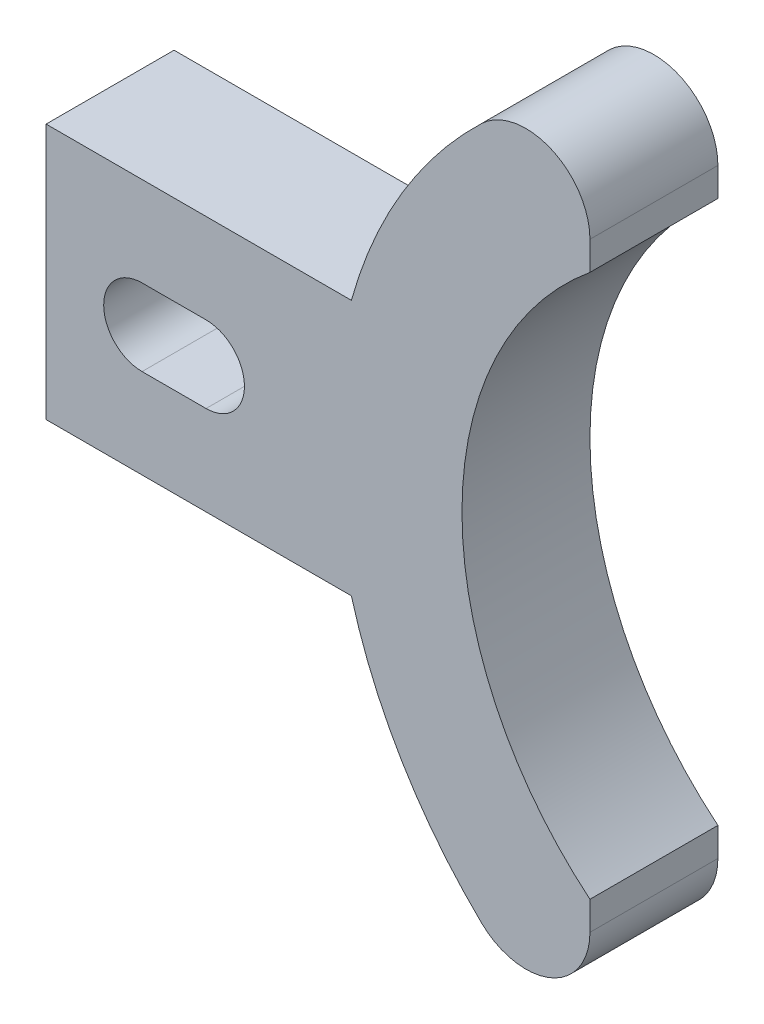
ISO-10303-21;
HEADER;
FILE_DESCRIPTION(('STEP AP214'),'2;1');
FILE_NAME('part.step','',(''),(''),'','','');
FILE_SCHEMA(('AUTOMOTIVE_DESIGN { 1 0 10303 214 1 1 1 1 }'));
ENDSEC;
DATA;
#1=APPLICATION_CONTEXT('core data for automotive mechanical design processes');
#2=APPLICATION_PROTOCOL_DEFINITION('international standard','automotive_design',2000,#1);
#3=PRODUCT_CONTEXT('',#1,'mechanical');
#4=PRODUCT('Part','Part','',(#3));
#5=PRODUCT_RELATED_PRODUCT_CATEGORY('part','',(#4));
#6=PRODUCT_DEFINITION_FORMATION('','',#4);
#7=PRODUCT_DEFINITION_CONTEXT('part definition',#1,'design');
#8=PRODUCT_DEFINITION('design','',#6,#7);
#9=PRODUCT_DEFINITION_SHAPE('','',#8);
#10=(LENGTH_UNIT() NAMED_UNIT(*) SI_UNIT(.MILLI.,.METRE.));
#11=(NAMED_UNIT(*) PLANE_ANGLE_UNIT() SI_UNIT($,.RADIAN.));
#12=(NAMED_UNIT(*) SI_UNIT($,.STERADIAN.) SOLID_ANGLE_UNIT());
#13=UNCERTAINTY_MEASURE_WITH_UNIT(LENGTH_MEASURE(1.E-05),#10,'distance_accuracy_value','');
#14=(GEOMETRIC_REPRESENTATION_CONTEXT(3) GLOBAL_UNCERTAINTY_ASSIGNED_CONTEXT((#13)) GLOBAL_UNIT_ASSIGNED_CONTEXT((#10,
#11,#12)) REPRESENTATION_CONTEXT('',''));
#15=CARTESIAN_POINT('',(0.,0.,0.));
#16=DIRECTION('',(0.,0.,1.));
#17=DIRECTION('',(1.,0.,0.));
#18=AXIS2_PLACEMENT_3D('',#15,#16,#17);
#19=CARTESIAN_POINT('',(76.2,12.7,12.7));
#20=DIRECTION('',(0.,0.,-1.));
#21=DIRECTION('',(-1.,0.,0.));
#22=AXIS2_PLACEMENT_3D('',#19,#20,#21);
#23=CYLINDRICAL_SURFACE('',#22,47.625);
#24=CARTESIAN_POINT('',(76.2,12.7,0.));
#25=DIRECTION('',(0.,0.,1.));
#26=DIRECTION('',(1.,0.,0.));
#27=AXIS2_PLACEMENT_3D('',#24,#25,#26);
#28=CIRCLE('',#27,47.625);
#29=CARTESIAN_POINT('',(30.2995574640069,0.,0.));
#30=VERTEX_POINT('',#29);
#31=CARTESIAN_POINT('',(43.2288461538462,-21.666315471014,0.));
#32=VERTEX_POINT('',#31);
#33=EDGE_CURVE('E234',#30,#32,#28,.T.);
#34=ORIENTED_EDGE('',*,*,#33,.T.);
#35=DIRECTION('',(0.,0.,-1.));
#36=VECTOR('',#35,1.);
#37=CARTESIAN_POINT('',(43.2288461538462,-21.666315471014,12.7));
#38=LINE('',#37,#36);
#39=CARTESIAN_POINT('',(43.2288461538462,-21.666315471014,12.7));
#40=VERTEX_POINT('',#39);
#41=EDGE_CURVE('E280',#32,#40,#38,.F.);
#42=ORIENTED_EDGE('',*,*,#41,.T.);
#43=CARTESIAN_POINT('',(76.2,12.7,12.7));
#44=DIRECTION('',(0.,0.,1.));
#45=DIRECTION('',(1.,0.,0.));
#46=AXIS2_PLACEMENT_3D('',#43,#44,#45);
#47=CIRCLE('',#46,47.625);
#48=CARTESIAN_POINT('',(30.2995574640069,0.,12.7));
#49=VERTEX_POINT('',#48);
#50=EDGE_CURVE('E209',#49,#40,#47,.T.);
#51=ORIENTED_EDGE('',*,*,#50,.F.);
#52=DIRECTION('',(0.,0.,-1.));
#53=VECTOR('',#52,1.);
#54=CARTESIAN_POINT('',(30.2995574640069,0.,12.7));
#55=LINE('',#54,#53);
#56=EDGE_CURVE('E261',#49,#30,#55,.T.);
#57=ORIENTED_EDGE('',*,*,#56,.T.);
#58=EDGE_LOOP('',(#34,#42,#51,#57));
#59=FACE_BOUND('',#58,.T.);
#60=ADVANCED_FACE('F41',(#59),#23,.T.);
#61=CARTESIAN_POINT('',(76.2,12.7,12.7));
#62=DIRECTION('',(0.,0.,-1.));
#63=DIRECTION('',(-1.,0.,0.));
#64=AXIS2_PLACEMENT_3D('',#61,#62,#63);
#65=CYLINDRICAL_SURFACE('',#64,34.925);
#66=CARTESIAN_POINT('',(76.2,12.7,12.7));
#67=DIRECTION('',(0.,0.,1.));
#68=DIRECTION('',(1.,0.,0.));
#69=AXIS2_PLACEMENT_3D('',#66,#67,#68);
#70=CIRCLE('',#69,34.925);
#71=CARTESIAN_POINT('',(53.975,39.6407683632075,12.7));
#72=VERTEX_POINT('',#71);
#73=CARTESIAN_POINT('',(53.975,-14.2407683632075,12.7));
#74=VERTEX_POINT('',#73);
#75=EDGE_CURVE('E214',#72,#74,#70,.T.);
#76=ORIENTED_EDGE('',*,*,#75,.T.);
#77=DIRECTION('',(0.,0.,-1.));
#78=VECTOR('',#77,1.);
#79=CARTESIAN_POINT('',(53.975,-14.2407683632075,12.7));
#80=LINE('',#79,#78);
#81=CARTESIAN_POINT('',(53.975,-14.2407683632075,0.));
#82=VERTEX_POINT('',#81);
#83=EDGE_CURVE('E200',#74,#82,#80,.T.);
#84=ORIENTED_EDGE('',*,*,#83,.T.);
#85=CARTESIAN_POINT('',(76.2,12.7,0.));
#86=DIRECTION('',(0.,0.,1.));
#87=DIRECTION('',(1.,0.,0.));
#88=AXIS2_PLACEMENT_3D('',#85,#86,#87);
#89=CIRCLE('',#88,34.925);
#90=CARTESIAN_POINT('',(53.975,39.6407683632075,0.));
#91=VERTEX_POINT('',#90);
#92=EDGE_CURVE('E238',#91,#82,#89,.T.);
#93=ORIENTED_EDGE('',*,*,#92,.F.);
#94=DIRECTION('',(0.,0.,-1.));
#95=VECTOR('',#94,1.);
#96=CARTESIAN_POINT('',(53.975,39.6407683632075,12.7));
#97=LINE('',#96,#95);
#98=EDGE_CURVE('E187',#91,#72,#97,.F.);
#99=ORIENTED_EDGE('',*,*,#98,.T.);
#100=EDGE_LOOP('',(#76,#84,#93,#99));
#101=FACE_BOUND('',#100,.T.);
#102=ADVANCED_FACE('F299',(#101),#65,.F.);
#103=CARTESIAN_POINT('',(76.2,12.7,12.7));
#104=DIRECTION('',(0.,0.,-1.));
#105=DIRECTION('',(-1.,0.,0.));
#106=AXIS2_PLACEMENT_3D('',#103,#104,#105);
#107=CYLINDRICAL_SURFACE('',#106,47.625);
#108=CARTESIAN_POINT('',(76.2,12.7,12.7));
#109=DIRECTION('',(0.,0.,1.));
#110=DIRECTION('',(1.,0.,0.));
#111=AXIS2_PLACEMENT_3D('',#108,#109,#110);
#112=CIRCLE('',#111,47.625);
#113=CARTESIAN_POINT('',(43.2288461538462,47.066315471014,12.7));
#114=VERTEX_POINT('',#113);
#115=CARTESIAN_POINT('',(30.2995574640069,25.4,12.7));
#116=VERTEX_POINT('',#115);
#117=EDGE_CURVE('E218',#114,#116,#112,.T.);
#118=ORIENTED_EDGE('',*,*,#117,.F.);
#119=DIRECTION('',(0.,0.,-1.));
#120=VECTOR('',#119,1.);
#121=CARTESIAN_POINT('',(43.2288461538462,47.066315471014,12.7));
#122=LINE('',#121,#120);
#123=CARTESIAN_POINT('',(43.2288461538462,47.066315471014,0.));
#124=VERTEX_POINT('',#123);
#125=EDGE_CURVE('E11',#114,#124,#122,.T.);
#126=ORIENTED_EDGE('',*,*,#125,.T.);
#127=CARTESIAN_POINT('',(76.2,12.7,0.));
#128=DIRECTION('',(0.,0.,1.));
#129=DIRECTION('',(1.,0.,0.));
#130=AXIS2_PLACEMENT_3D('',#127,#128,#129);
#131=CIRCLE('',#130,47.625);
#132=CARTESIAN_POINT('',(30.2995574640069,25.4,0.));
#133=VERTEX_POINT('',#132);
#134=EDGE_CURVE('E242',#124,#133,#131,.T.);
#135=ORIENTED_EDGE('',*,*,#134,.T.);
#136=DIRECTION('',(0.,0.,-1.));
#137=VECTOR('',#136,1.);
#138=CARTESIAN_POINT('',(30.2995574640069,25.4,12.7));
#139=LINE('',#138,#137);
#140=EDGE_CURVE('E257',#116,#133,#139,.T.);
#141=ORIENTED_EDGE('',*,*,#140,.F.);
#142=EDGE_LOOP('',(#118,#126,#135,#141));
#143=FACE_BOUND('',#142,.T.);
#144=ADVANCED_FACE('F307',(#143),#107,.T.);
#145=CARTESIAN_POINT('',(0.,0.,12.7));
#146=DIRECTION('',(0.,0.,1.));
#147=DIRECTION('',(1.,0.,0.));
#148=AXIS2_PLACEMENT_3D('',#145,#146,#147);
#149=PLANE('',#148);
#150=CARTESIAN_POINT('',(15.875,12.7,12.7));
#151=DIRECTION('',(0.,0.,-1.));
#152=DIRECTION('',(-1.,0.,0.));
#153=AXIS2_PLACEMENT_3D('',#150,#151,#152);
#154=CIRCLE('',#153,3.81);
#155=CARTESIAN_POINT('',(15.875,16.51,12.7));
#156=VERTEX_POINT('',#155);
#157=CARTESIAN_POINT('',(15.875,8.89,12.7));
#158=VERTEX_POINT('',#157);
#159=EDGE_CURVE('E145',#156,#158,#154,.T.);
#160=ORIENTED_EDGE('',*,*,#159,.T.);
#161=DIRECTION('',(-1.,0.,0.));
#162=VECTOR('',#161,1.);
#163=CARTESIAN_POINT('',(15.875,8.89,12.7));
#164=LINE('',#163,#162);
#165=CARTESIAN_POINT('',(9.525,8.89,12.7));
#166=VERTEX_POINT('',#165);
#167=EDGE_CURVE('E153',#158,#166,#164,.T.);
#168=ORIENTED_EDGE('',*,*,#167,.T.);
#169=CARTESIAN_POINT('',(9.525,12.7,12.7));
#170=DIRECTION('',(0.,0.,-1.));
#171=DIRECTION('',(-1.,0.,0.));
#172=AXIS2_PLACEMENT_3D('',#169,#170,#171);
#173=CIRCLE('',#172,3.81);
#174=CARTESIAN_POINT('',(9.525,16.51,12.7));
#175=VERTEX_POINT('',#174);
#176=EDGE_CURVE('E160',#166,#175,#173,.T.);
#177=ORIENTED_EDGE('',*,*,#176,.T.);
#178=DIRECTION('',(1.,0.,0.));
#179=VECTOR('',#178,1.);
#180=CARTESIAN_POINT('',(15.875,16.51,12.7));
#181=LINE('',#180,#179);
#182=EDGE_CURVE('E150',#175,#156,#181,.T.);
#183=ORIENTED_EDGE('',*,*,#182,.T.);
#184=EDGE_LOOP('',(#160,#168,#177,#183));
#185=FACE_BOUND('',#184,.T.);
#186=ORIENTED_EDGE('',*,*,#50,.T.);
#187=CARTESIAN_POINT('',(47.625,-17.0841400748788,12.7));
#188=DIRECTION('',(0.,0.,1.));
#189=DIRECTION('',(1.,0.,0.));
#190=AXIS2_PLACEMENT_3D('',#187,#188,#189);
#191=CIRCLE('',#190,6.35);
#192=CARTESIAN_POINT('',(53.975,-17.0841400748788,12.7));
#193=VERTEX_POINT('',#192);
#194=EDGE_CURVE('E285',#40,#193,#191,.T.);
#195=ORIENTED_EDGE('',*,*,#194,.T.);
#196=DIRECTION('',(0.,1.,0.));
#197=VECTOR('',#196,1.);
#198=CARTESIAN_POINT('',(53.975,0.,12.7));
#199=LINE('',#198,#197);
#200=EDGE_CURVE('E201',#193,#74,#199,.T.);
#201=ORIENTED_EDGE('',*,*,#200,.T.);
#202=ORIENTED_EDGE('',*,*,#75,.F.);
#203=CARTESIAN_POINT('',(53.975,42.4841400748788,12.7));
#204=VERTEX_POINT('',#203);
#205=EDGE_CURVE('E197',#72,#204,#199,.T.);
#206=ORIENTED_EDGE('',*,*,#205,.T.);
#207=CARTESIAN_POINT('',(47.625,42.4841400748788,12.7));
#208=DIRECTION('',(0.,0.,1.));
#209=DIRECTION('',(1.,0.,0.));
#210=AXIS2_PLACEMENT_3D('',#207,#208,#209);
#211=CIRCLE('',#210,6.35);
#212=EDGE_CURVE('E65',#204,#114,#211,.T.);
#213=ORIENTED_EDGE('',*,*,#212,.T.);
#214=ORIENTED_EDGE('',*,*,#117,.T.);
#215=DIRECTION('',(1.,0.,0.));
#216=VECTOR('',#215,1.);
#217=CARTESIAN_POINT('',(0.,25.4,12.7));
#218=LINE('',#217,#216);
#219=CARTESIAN_POINT('',(0.,25.4,12.7));
#220=VERTEX_POINT('',#219);
#221=EDGE_CURVE('E221',#220,#116,#218,.T.);
#222=ORIENTED_EDGE('',*,*,#221,.F.);
#223=DIRECTION('',(0.,1.,0.));
#224=VECTOR('',#223,1.);
#225=CARTESIAN_POINT('',(0.,0.,12.7));
#226=LINE('',#225,#224);
#227=CARTESIAN_POINT('',(0.,0.,12.7));
#228=VERTEX_POINT('',#227);
#229=EDGE_CURVE('E225',#228,#220,#226,.T.);
#230=ORIENTED_EDGE('',*,*,#229,.F.);
#231=DIRECTION('',(1.,0.,0.));
#232=VECTOR('',#231,1.);
#233=CARTESIAN_POINT('',(0.,0.,12.7));
#234=LINE('',#233,#232);
#235=EDGE_CURVE('E205',#228,#49,#234,.T.);
#236=ORIENTED_EDGE('',*,*,#235,.T.);
#237=EDGE_LOOP('',(#186,#195,#201,#202,#206,#213,#214,#222,#230,#236));
#238=FACE_BOUND('',#237,.T.);
#239=ADVANCED_FACE('F162',(#185,#238),#149,.T.);
#240=CARTESIAN_POINT('',(0.,0.,0.));
#241=DIRECTION('',(0.,0.,1.));
#242=DIRECTION('',(1.,0.,0.));
#243=AXIS2_PLACEMENT_3D('',#240,#241,#242);
#244=PLANE('',#243);
#245=DIRECTION('',(-1.,0.,0.));
#246=VECTOR('',#245,1.);
#247=CARTESIAN_POINT('',(15.875,8.89,0.));
#248=LINE('',#247,#246);
#249=CARTESIAN_POINT('',(15.875,8.89,0.));
#250=VERTEX_POINT('',#249);
#251=CARTESIAN_POINT('',(9.525,8.89,0.));
#252=VERTEX_POINT('',#251);
#253=EDGE_CURVE('E178',#250,#252,#248,.T.);
#254=ORIENTED_EDGE('',*,*,#253,.F.);
#255=CARTESIAN_POINT('',(15.875,12.7,0.));
#256=DIRECTION('',(0.,0.,-1.));
#257=DIRECTION('',(-1.,0.,0.));
#258=AXIS2_PLACEMENT_3D('',#255,#256,#257);
#259=CIRCLE('',#258,3.81);
#260=CARTESIAN_POINT('',(15.875,16.51,0.));
#261=VERTEX_POINT('',#260);
#262=EDGE_CURVE('E57',#261,#250,#259,.T.);
#263=ORIENTED_EDGE('',*,*,#262,.F.);
#264=DIRECTION('',(1.,0.,0.));
#265=VECTOR('',#264,1.);
#266=CARTESIAN_POINT('',(15.875,16.51,0.));
#267=LINE('',#266,#265);
#268=CARTESIAN_POINT('',(9.525,16.51,0.));
#269=VERTEX_POINT('',#268);
#270=EDGE_CURVE('E166',#269,#261,#267,.T.);
#271=ORIENTED_EDGE('',*,*,#270,.F.);
#272=CARTESIAN_POINT('',(9.525,12.7,0.));
#273=DIRECTION('',(0.,0.,-1.));
#274=DIRECTION('',(-1.,0.,0.));
#275=AXIS2_PLACEMENT_3D('',#272,#273,#274);
#276=CIRCLE('',#275,3.81);
#277=EDGE_CURVE('E169',#252,#269,#276,.T.);
#278=ORIENTED_EDGE('',*,*,#277,.F.);
#279=EDGE_LOOP('',(#254,#263,#271,#278));
#280=FACE_BOUND('',#279,.T.);
#281=DIRECTION('',(0.,1.,0.));
#282=VECTOR('',#281,1.);
#283=CARTESIAN_POINT('',(53.975,0.,0.));
#284=LINE('',#283,#282);
#285=CARTESIAN_POINT('',(53.975,-17.0841400748788,0.));
#286=VERTEX_POINT('',#285);
#287=EDGE_CURVE('E269',#286,#82,#284,.T.);
#288=ORIENTED_EDGE('',*,*,#287,.F.);
#289=CARTESIAN_POINT('',(47.625,-17.0841400748788,0.));
#290=DIRECTION('',(0.,0.,1.));
#291=DIRECTION('',(1.,0.,0.));
#292=AXIS2_PLACEMENT_3D('',#289,#290,#291);
#293=CIRCLE('',#292,6.35);
#294=EDGE_CURVE('E277',#286,#32,#293,.F.);
#295=ORIENTED_EDGE('',*,*,#294,.T.);
#296=ORIENTED_EDGE('',*,*,#33,.F.);
#297=DIRECTION('',(1.,0.,0.));
#298=VECTOR('',#297,1.);
#299=CARTESIAN_POINT('',(0.,0.,0.));
#300=LINE('',#299,#298);
#301=CARTESIAN_POINT('',(0.,0.,0.));
#302=VERTEX_POINT('',#301);
#303=EDGE_CURVE('E230',#302,#30,#300,.T.);
#304=ORIENTED_EDGE('',*,*,#303,.F.);
#305=DIRECTION('',(0.,1.,0.));
#306=VECTOR('',#305,1.);
#307=CARTESIAN_POINT('',(0.,0.,0.));
#308=LINE('',#307,#306);
#309=CARTESIAN_POINT('',(0.,25.4,0.));
#310=VERTEX_POINT('',#309);
#311=EDGE_CURVE('E210',#302,#310,#308,.T.);
#312=ORIENTED_EDGE('',*,*,#311,.T.);
#313=DIRECTION('',(1.,0.,0.));
#314=VECTOR('',#313,1.);
#315=CARTESIAN_POINT('',(0.,25.4,0.));
#316=LINE('',#315,#314);
#317=EDGE_CURVE('E245',#310,#133,#316,.T.);
#318=ORIENTED_EDGE('',*,*,#317,.T.);
#319=ORIENTED_EDGE('',*,*,#134,.F.);
#320=CARTESIAN_POINT('',(47.625,42.4841400748788,0.));
#321=DIRECTION('',(0.,0.,1.));
#322=DIRECTION('',(1.,0.,0.));
#323=AXIS2_PLACEMENT_3D('',#320,#321,#322);
#324=CIRCLE('',#323,6.35);
#325=CARTESIAN_POINT('',(53.975,42.4841400748788,0.));
#326=VERTEX_POINT('',#325);
#327=EDGE_CURVE('E274',#124,#326,#324,.F.);
#328=ORIENTED_EDGE('',*,*,#327,.T.);
#329=EDGE_CURVE('E265',#91,#326,#284,.T.);
#330=ORIENTED_EDGE('',*,*,#329,.F.);
#331=ORIENTED_EDGE('',*,*,#92,.T.);
#332=EDGE_LOOP('',(#288,#295,#296,#304,#312,#318,#319,#328,#330,#331));
#333=FACE_BOUND('',#332,.T.);
#334=ADVANCED_FACE('F303',(#280,#333),#244,.F.);
#335=CARTESIAN_POINT('',(0.,0.,12.7));
#336=DIRECTION('',(0.,1.,0.));
#337=DIRECTION('',(0.,0.,1.));
#338=AXIS2_PLACEMENT_3D('',#335,#336,#337);
#339=PLANE('',#338);
#340=ORIENTED_EDGE('',*,*,#303,.T.);
#341=ORIENTED_EDGE('',*,*,#56,.F.);
#342=ORIENTED_EDGE('',*,*,#235,.F.);
#343=DIRECTION('',(0.,0.,-1.));
#344=VECTOR('',#343,1.);
#345=CARTESIAN_POINT('',(0.,0.,12.7));
#346=LINE('',#345,#344);
#347=EDGE_CURVE('E229',#228,#302,#346,.T.);
#348=ORIENTED_EDGE('',*,*,#347,.T.);
#349=EDGE_LOOP('',(#340,#341,#342,#348));
#350=FACE_BOUND('',#349,.T.);
#351=ADVANCED_FACE('F320',(#350),#339,.F.);
#352=CARTESIAN_POINT('',(0.,25.4,12.7));
#353=DIRECTION('',(0.,1.,0.));
#354=DIRECTION('',(0.,0.,1.));
#355=AXIS2_PLACEMENT_3D('',#352,#353,#354);
#356=PLANE('',#355);
#357=ORIENTED_EDGE('',*,*,#317,.F.);
#358=DIRECTION('',(0.,0.,-1.));
#359=VECTOR('',#358,1.);
#360=CARTESIAN_POINT('',(0.,25.4,12.7));
#361=LINE('',#360,#359);
#362=EDGE_CURVE('E254',#220,#310,#361,.T.);
#363=ORIENTED_EDGE('',*,*,#362,.F.);
#364=ORIENTED_EDGE('',*,*,#221,.T.);
#365=ORIENTED_EDGE('',*,*,#140,.T.);
#366=EDGE_LOOP('',(#357,#363,#364,#365));
#367=FACE_BOUND('',#366,.T.);
#368=ADVANCED_FACE('F331',(#367),#356,.T.);
#369=CARTESIAN_POINT('',(0.,0.,12.7));
#370=DIRECTION('',(-1.,0.,0.));
#371=DIRECTION('',(0.,0.,1.));
#372=AXIS2_PLACEMENT_3D('',#369,#370,#371);
#373=PLANE('',#372);
#374=ORIENTED_EDGE('',*,*,#311,.F.);
#375=ORIENTED_EDGE('',*,*,#347,.F.);
#376=ORIENTED_EDGE('',*,*,#229,.T.);
#377=ORIENTED_EDGE('',*,*,#362,.T.);
#378=EDGE_LOOP('',(#374,#375,#376,#377));
#379=FACE_BOUND('',#378,.T.);
#380=ADVANCED_FACE('F314',(#379),#373,.T.);
#381=CARTESIAN_POINT('',(53.975,0.,0.));
#382=DIRECTION('',(1.,0.,0.));
#383=DIRECTION('',(0.,0.,-1.));
#384=AXIS2_PLACEMENT_3D('',#381,#382,#383);
#385=PLANE('',#384);
#386=ORIENTED_EDGE('',*,*,#329,.T.);
#387=DIRECTION('',(0.,0.,1.));
#388=VECTOR('',#387,1.);
#389=CARTESIAN_POINT('',(53.975,42.4841400748788,12.7));
#390=LINE('',#389,#388);
#391=EDGE_CURVE('E50',#326,#204,#390,.T.);
#392=ORIENTED_EDGE('',*,*,#391,.T.);
#393=ORIENTED_EDGE('',*,*,#205,.F.);
#394=ORIENTED_EDGE('',*,*,#98,.F.);
#395=EDGE_LOOP('',(#386,#392,#393,#394));
#396=FACE_BOUND('',#395,.T.);
#397=ADVANCED_FACE('F291',(#396),#385,.T.);
#398=ORIENTED_EDGE('',*,*,#200,.F.);
#399=DIRECTION('',(0.,0.,1.));
#400=VECTOR('',#399,1.);
#401=CARTESIAN_POINT('',(53.975,-17.0841400748788,0.));
#402=LINE('',#401,#400);
#403=EDGE_CURVE('E270',#193,#286,#402,.F.);
#404=ORIENTED_EDGE('',*,*,#403,.T.);
#405=ORIENTED_EDGE('',*,*,#287,.T.);
#406=ORIENTED_EDGE('',*,*,#83,.F.);
#407=EDGE_LOOP('',(#398,#404,#405,#406));
#408=FACE_BOUND('',#407,.T.);
#409=ADVANCED_FACE('F328',(#408),#385,.T.);
#410=CARTESIAN_POINT('',(47.625,-17.0841400748788,12.7));
#411=DIRECTION('',(0.,0.,-1.));
#412=DIRECTION('',(-1.,0.,0.));
#413=AXIS2_PLACEMENT_3D('',#410,#411,#412);
#414=CYLINDRICAL_SURFACE('',#413,6.35);
#415=ORIENTED_EDGE('',*,*,#194,.F.);
#416=ORIENTED_EDGE('',*,*,#41,.F.);
#417=ORIENTED_EDGE('',*,*,#294,.F.);
#418=ORIENTED_EDGE('',*,*,#403,.F.);
#419=EDGE_LOOP('',(#415,#416,#417,#418));
#420=FACE_BOUND('',#419,.T.);
#421=ADVANCED_FACE('F326',(#420),#414,.T.);
#422=CARTESIAN_POINT('',(47.625,42.4841400748788,12.7));
#423=DIRECTION('',(0.,0.,-1.));
#424=DIRECTION('',(-1.,0.,0.));
#425=AXIS2_PLACEMENT_3D('',#422,#423,#424);
#426=CYLINDRICAL_SURFACE('',#425,6.35);
#427=ORIENTED_EDGE('',*,*,#327,.F.);
#428=ORIENTED_EDGE('',*,*,#125,.F.);
#429=ORIENTED_EDGE('',*,*,#212,.F.);
#430=ORIENTED_EDGE('',*,*,#391,.F.);
#431=EDGE_LOOP('',(#427,#428,#429,#430));
#432=FACE_BOUND('',#431,.T.);
#433=ADVANCED_FACE('F43',(#432),#426,.T.);
#434=CARTESIAN_POINT('',(15.875,16.51,12.7));
#435=DIRECTION('',(0.,1.,0.));
#436=DIRECTION('',(0.,0.,1.));
#437=AXIS2_PLACEMENT_3D('',#434,#435,#436);
#438=PLANE('',#437);
#439=ORIENTED_EDGE('',*,*,#182,.F.);
#440=DIRECTION('',(0.,0.,-1.));
#441=VECTOR('',#440,1.);
#442=CARTESIAN_POINT('',(9.525,16.51,12.7));
#443=LINE('',#442,#441);
#444=EDGE_CURVE('E188',#175,#269,#443,.T.);
#445=ORIENTED_EDGE('',*,*,#444,.T.);
#446=ORIENTED_EDGE('',*,*,#270,.T.);
#447=DIRECTION('',(0.,0.,-1.));
#448=VECTOR('',#447,1.);
#449=CARTESIAN_POINT('',(15.875,16.51,12.7));
#450=LINE('',#449,#448);
#451=EDGE_CURVE('E184',#156,#261,#450,.T.);
#452=ORIENTED_EDGE('',*,*,#451,.F.);
#453=EDGE_LOOP('',(#439,#445,#446,#452));
#454=FACE_BOUND('',#453,.T.);
#455=ADVANCED_FACE('F352',(#454),#438,.F.);
#456=CARTESIAN_POINT('',(15.875,8.89,12.7));
#457=DIRECTION('',(0.,-1.,0.));
#458=DIRECTION('',(1.,0.,0.));
#459=AXIS2_PLACEMENT_3D('',#456,#457,#458);
#460=PLANE('',#459);
#461=ORIENTED_EDGE('',*,*,#167,.F.);
#462=DIRECTION('',(0.,0.,-1.));
#463=VECTOR('',#462,1.);
#464=CARTESIAN_POINT('',(15.875,8.89,12.7));
#465=LINE('',#464,#463);
#466=EDGE_CURVE('E141',#158,#250,#465,.T.);
#467=ORIENTED_EDGE('',*,*,#466,.T.);
#468=ORIENTED_EDGE('',*,*,#253,.T.);
#469=DIRECTION('',(0.,0.,-1.));
#470=VECTOR('',#469,1.);
#471=CARTESIAN_POINT('',(9.525,8.89,12.7));
#472=LINE('',#471,#470);
#473=EDGE_CURVE('E149',#166,#252,#472,.T.);
#474=ORIENTED_EDGE('',*,*,#473,.F.);
#475=EDGE_LOOP('',(#461,#467,#468,#474));
#476=FACE_BOUND('',#475,.T.);
#477=ADVANCED_FACE('F154',(#476),#460,.F.);
#478=CARTESIAN_POINT('',(15.875,12.7,12.7));
#479=DIRECTION('',(0.,0.,-1.));
#480=DIRECTION('',(-1.,0.,0.));
#481=AXIS2_PLACEMENT_3D('',#478,#479,#480);
#482=CYLINDRICAL_SURFACE('',#481,3.81);
#483=ORIENTED_EDGE('',*,*,#262,.T.);
#484=ORIENTED_EDGE('',*,*,#466,.F.);
#485=ORIENTED_EDGE('',*,*,#159,.F.);
#486=ORIENTED_EDGE('',*,*,#451,.T.);
#487=EDGE_LOOP('',(#483,#484,#485,#486));
#488=FACE_BOUND('',#487,.T.);
#489=ADVANCED_FACE('F143',(#488),#482,.F.);
#490=CARTESIAN_POINT('',(9.525,12.7,12.7));
#491=DIRECTION('',(0.,0.,-1.));
#492=DIRECTION('',(-1.,0.,0.));
#493=AXIS2_PLACEMENT_3D('',#490,#491,#492);
#494=CYLINDRICAL_SURFACE('',#493,3.81);
#495=ORIENTED_EDGE('',*,*,#277,.T.);
#496=ORIENTED_EDGE('',*,*,#444,.F.);
#497=ORIENTED_EDGE('',*,*,#176,.F.);
#498=ORIENTED_EDGE('',*,*,#473,.T.);
#499=EDGE_LOOP('',(#495,#496,#497,#498));
#500=FACE_BOUND('',#499,.T.);
#501=ADVANCED_FACE('F368',(#500),#494,.F.);
#502=CLOSED_SHELL('',(#60,#102,#144,#239,#334,#351,#368,#380,#397,#409,#421,#433,#455,#477,#489,#501));
#503=MANIFOLD_SOLID_BREP('B2',#502);
#504=ADVANCED_BREP_SHAPE_REPRESENTATION('',(#18,#503),#14);
#505=SHAPE_DEFINITION_REPRESENTATION(#9,#504);
ENDSEC;
END-ISO-10303-21;
